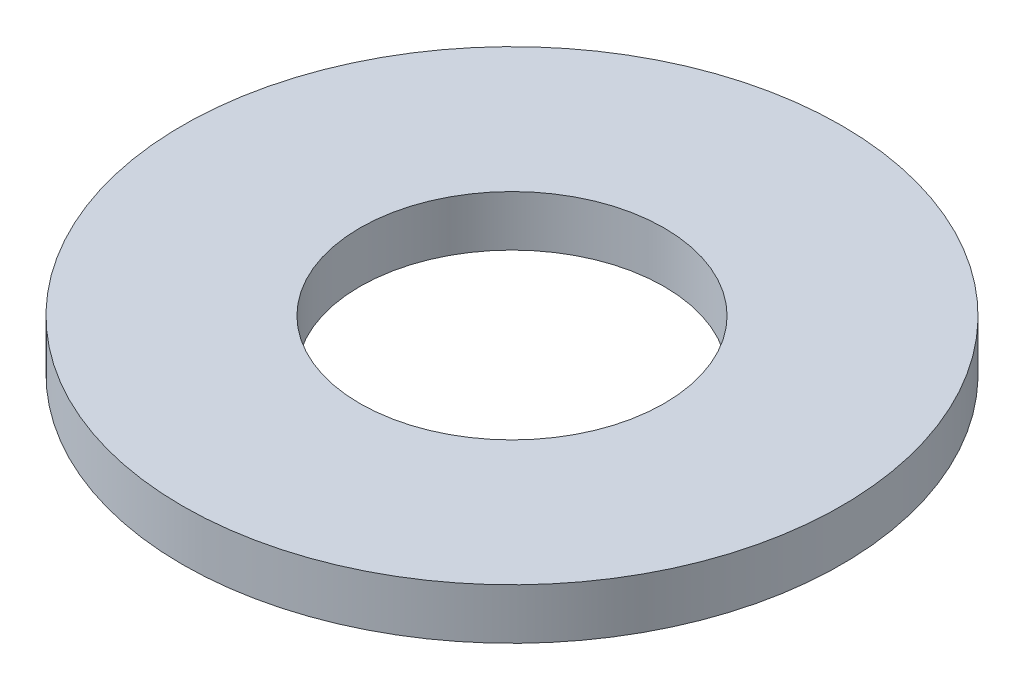
ISO-10303-21;
HEADER;
FILE_DESCRIPTION(('STEP AP214'),'2;1');
FILE_NAME('part.step','',(''),(''),'','','');
FILE_SCHEMA(('AUTOMOTIVE_DESIGN { 1 0 10303 214 1 1 1 1 }'));
ENDSEC;
DATA;
#1=APPLICATION_CONTEXT('core data for automotive mechanical design processes');
#2=APPLICATION_PROTOCOL_DEFINITION('international standard','automotive_design',2000,#1);
#3=PRODUCT_CONTEXT('',#1,'mechanical');
#4=PRODUCT('Part','Part','',(#3));
#5=PRODUCT_RELATED_PRODUCT_CATEGORY('part','',(#4));
#6=PRODUCT_DEFINITION_FORMATION('','',#4);
#7=PRODUCT_DEFINITION_CONTEXT('part definition',#1,'design');
#8=PRODUCT_DEFINITION('design','',#6,#7);
#9=PRODUCT_DEFINITION_SHAPE('','',#8);
#10=(LENGTH_UNIT() NAMED_UNIT(*) SI_UNIT(.MILLI.,.METRE.));
#11=(NAMED_UNIT(*) PLANE_ANGLE_UNIT() SI_UNIT($,.RADIAN.));
#12=(NAMED_UNIT(*) SI_UNIT($,.STERADIAN.) SOLID_ANGLE_UNIT());
#13=UNCERTAINTY_MEASURE_WITH_UNIT(LENGTH_MEASURE(1.E-05),#10,'distance_accuracy_value','');
#14=(GEOMETRIC_REPRESENTATION_CONTEXT(3) GLOBAL_UNCERTAINTY_ASSIGNED_CONTEXT((#13)) GLOBAL_UNIT_ASSIGNED_CONTEXT((#10,
#11,#12)) REPRESENTATION_CONTEXT('',''));
#15=CARTESIAN_POINT('',(0.,0.,0.));
#16=DIRECTION('',(0.,0.,1.));
#17=DIRECTION('',(1.,0.,0.));
#18=AXIS2_PLACEMENT_3D('',#15,#16,#17);
#19=CARTESIAN_POINT('',(0.,0.,0.));
#20=DIRECTION('',(0.,1.,0.));
#21=DIRECTION('',(0.,0.,1.));
#22=AXIS2_PLACEMENT_3D('',#19,#20,#21);
#23=CYLINDRICAL_SURFACE('',#22,6.);
#24=CARTESIAN_POINT('',(0.,2.,0.));
#25=DIRECTION('',(0.,1.,0.));
#26=DIRECTION('',(0.,0.,1.));
#27=AXIS2_PLACEMENT_3D('',#24,#25,#26);
#28=CIRCLE('',#27,6.);
#29=CARTESIAN_POINT('',(0.,2.,6.));
#30=VERTEX_POINT('',#29);
#31=EDGE_CURVE('E10',#30,#30,#28,.T.);
#32=ORIENTED_EDGE('',*,*,#31,.T.);
#33=EDGE_LOOP('',(#32));
#34=FACE_BOUND('',#33,.T.);
#35=CARTESIAN_POINT('',(0.,0.,0.));
#36=DIRECTION('',(0.,1.,0.));
#37=DIRECTION('',(0.,0.,1.));
#38=AXIS2_PLACEMENT_3D('',#35,#36,#37);
#39=CIRCLE('',#38,6.);
#40=CARTESIAN_POINT('',(0.,0.,6.));
#41=VERTEX_POINT('',#40);
#42=EDGE_CURVE('E47',#41,#41,#39,.T.);
#43=ORIENTED_EDGE('',*,*,#42,.F.);
#44=EDGE_LOOP('',(#43));
#45=FACE_BOUND('',#44,.T.);
#46=ADVANCED_FACE('F33',(#34,#45),#23,.F.);
#47=CARTESIAN_POINT('',(6.,2.,0.));
#48=DIRECTION('',(0.,1.,0.));
#49=DIRECTION('',(0.,0.,1.));
#50=AXIS2_PLACEMENT_3D('',#47,#48,#49);
#51=PLANE('',#50);
#52=CARTESIAN_POINT('',(0.,2.,0.));
#53=DIRECTION('',(0.,1.,0.));
#54=DIRECTION('',(0.,0.,1.));
#55=AXIS2_PLACEMENT_3D('',#52,#53,#54);
#56=CIRCLE('',#55,13.);
#57=CARTESIAN_POINT('',(0.,2.,13.));
#58=VERTEX_POINT('',#57);
#59=EDGE_CURVE('E39',#58,#58,#56,.T.);
#60=ORIENTED_EDGE('',*,*,#59,.T.);
#61=EDGE_LOOP('',(#60));
#62=FACE_BOUND('',#61,.T.);
#63=ORIENTED_EDGE('',*,*,#31,.F.);
#64=EDGE_LOOP('',(#63));
#65=FACE_BOUND('',#64,.T.);
#66=ADVANCED_FACE('F57',(#62,#65),#51,.T.);
#67=CARTESIAN_POINT('',(0.,0.,0.));
#68=DIRECTION('',(0.,1.,0.));
#69=DIRECTION('',(0.,0.,1.));
#70=AXIS2_PLACEMENT_3D('',#67,#68,#69);
#71=CYLINDRICAL_SURFACE('',#70,13.);
#72=CARTESIAN_POINT('',(0.,0.,0.));
#73=DIRECTION('',(0.,1.,0.));
#74=DIRECTION('',(0.,0.,1.));
#75=AXIS2_PLACEMENT_3D('',#72,#73,#74);
#76=CIRCLE('',#75,13.);
#77=CARTESIAN_POINT('',(0.,0.,13.));
#78=VERTEX_POINT('',#77);
#79=EDGE_CURVE('E43',#78,#78,#76,.T.);
#80=ORIENTED_EDGE('',*,*,#79,.T.);
#81=EDGE_LOOP('',(#80));
#82=FACE_BOUND('',#81,.T.);
#83=ORIENTED_EDGE('',*,*,#59,.F.);
#84=EDGE_LOOP('',(#83));
#85=FACE_BOUND('',#84,.T.);
#86=ADVANCED_FACE('F61',(#82,#85),#71,.T.);
#87=CARTESIAN_POINT('',(13.,0.,0.));
#88=DIRECTION('',(0.,-1.,0.));
#89=DIRECTION('',(0.,0.,-1.));
#90=AXIS2_PLACEMENT_3D('',#87,#88,#89);
#91=PLANE('',#90);
#92=ORIENTED_EDGE('',*,*,#42,.T.);
#93=EDGE_LOOP('',(#92));
#94=FACE_BOUND('',#93,.T.);
#95=ORIENTED_EDGE('',*,*,#79,.F.);
#96=EDGE_LOOP('',(#95));
#97=FACE_BOUND('',#96,.T.);
#98=ADVANCED_FACE('F53',(#94,#97),#91,.T.);
#99=CLOSED_SHELL('',(#46,#66,#86,#98));
#100=MANIFOLD_SOLID_BREP('B2',#99);
#101=ADVANCED_BREP_SHAPE_REPRESENTATION('',(#18,#100),#14);
#102=SHAPE_DEFINITION_REPRESENTATION(#9,#101);
ENDSEC;
END-ISO-10303-21;
